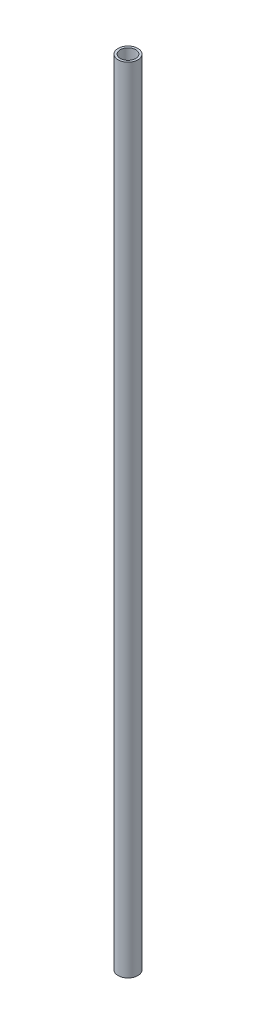
ISO-10303-21;
HEADER;
FILE_DESCRIPTION(('STEP AP214'),'2;1');
FILE_NAME('part.step','',(''),(''),'','','');
FILE_SCHEMA(('AUTOMOTIVE_DESIGN { 1 0 10303 214 1 1 1 1 }'));
ENDSEC;
DATA;
#1=APPLICATION_CONTEXT('core data for automotive mechanical design processes');
#2=APPLICATION_PROTOCOL_DEFINITION('international standard','automotive_design',2000,#1);
#3=PRODUCT_CONTEXT('',#1,'mechanical');
#4=PRODUCT('Part','Part','',(#3));
#5=PRODUCT_RELATED_PRODUCT_CATEGORY('part','',(#4));
#6=PRODUCT_DEFINITION_FORMATION('','',#4);
#7=PRODUCT_DEFINITION_CONTEXT('part definition',#1,'design');
#8=PRODUCT_DEFINITION('design','',#6,#7);
#9=PRODUCT_DEFINITION_SHAPE('','',#8);
#10=(LENGTH_UNIT() NAMED_UNIT(*) SI_UNIT(.MILLI.,.METRE.));
#11=(NAMED_UNIT(*) PLANE_ANGLE_UNIT() SI_UNIT($,.RADIAN.));
#12=(NAMED_UNIT(*) SI_UNIT($,.STERADIAN.) SOLID_ANGLE_UNIT());
#13=UNCERTAINTY_MEASURE_WITH_UNIT(LENGTH_MEASURE(1.E-05),#10,'distance_accuracy_value','');
#14=(GEOMETRIC_REPRESENTATION_CONTEXT(3) GLOBAL_UNCERTAINTY_ASSIGNED_CONTEXT((#13)) GLOBAL_UNIT_ASSIGNED_CONTEXT((#10,
#11,#12)) REPRESENTATION_CONTEXT('',''));
#15=CARTESIAN_POINT('',(0.,0.,0.));
#16=DIRECTION('',(0.,0.,1.));
#17=DIRECTION('',(1.,0.,0.));
#18=AXIS2_PLACEMENT_3D('',#15,#16,#17);
#19=CARTESIAN_POINT('',(0.,127.,0.));
#20=DIRECTION('',(0.,-1.,0.));
#21=DIRECTION('',(0.,0.,-1.));
#22=AXIS2_PLACEMENT_3D('',#19,#20,#21);
#23=CYLINDRICAL_SURFACE('',#22,1.5875);
#24=CARTESIAN_POINT('',(0.,127.,0.));
#25=DIRECTION('',(0.,1.,0.));
#26=DIRECTION('',(0.,0.,1.));
#27=AXIS2_PLACEMENT_3D('',#24,#25,#26);
#28=CIRCLE('',#27,1.5875);
#29=CARTESIAN_POINT('',(0.,127.,1.5875));
#30=VERTEX_POINT('',#29);
#31=EDGE_CURVE('E10',#30,#30,#28,.T.);
#32=ORIENTED_EDGE('',*,*,#31,.F.);
#33=EDGE_LOOP('',(#32));
#34=FACE_BOUND('',#33,.T.);
#35=CARTESIAN_POINT('',(0.,0.,0.));
#36=DIRECTION('',(0.,1.,0.));
#37=DIRECTION('',(0.,0.,1.));
#38=AXIS2_PLACEMENT_3D('',#35,#36,#37);
#39=CIRCLE('',#38,1.5875);
#40=CARTESIAN_POINT('',(0.,0.,1.5875));
#41=VERTEX_POINT('',#40);
#42=EDGE_CURVE('E34',#41,#41,#39,.T.);
#43=ORIENTED_EDGE('',*,*,#42,.T.);
#44=EDGE_LOOP('',(#43));
#45=FACE_BOUND('',#44,.T.);
#46=ADVANCED_FACE('F31',(#34,#45),#23,.T.);
#47=CARTESIAN_POINT('',(0.,127.,0.));
#48=DIRECTION('',(0.,1.,0.));
#49=DIRECTION('',(0.,0.,1.));
#50=AXIS2_PLACEMENT_3D('',#47,#48,#49);
#51=PLANE('',#50);
#52=CARTESIAN_POINT('',(0.,127.,0.));
#53=DIRECTION('',(0.,1.,0.));
#54=DIRECTION('',(0.,0.,1.));
#55=AXIS2_PLACEMENT_3D('',#52,#53,#54);
#56=CIRCLE('',#55,1.2319);
#57=CARTESIAN_POINT('',(0.,127.,1.2319));
#58=VERTEX_POINT('',#57);
#59=EDGE_CURVE('E43',#58,#58,#56,.T.);
#60=ORIENTED_EDGE('',*,*,#59,.F.);
#61=EDGE_LOOP('',(#60));
#62=FACE_BOUND('',#61,.T.);
#63=ORIENTED_EDGE('',*,*,#31,.T.);
#64=EDGE_LOOP('',(#63));
#65=FACE_BOUND('',#64,.T.);
#66=ADVANCED_FACE('F58',(#62,#65),#51,.T.);
#67=CARTESIAN_POINT('',(0.,0.,0.));
#68=DIRECTION('',(0.,1.,0.));
#69=DIRECTION('',(0.,0.,1.));
#70=AXIS2_PLACEMENT_3D('',#67,#68,#69);
#71=PLANE('',#70);
#72=CARTESIAN_POINT('',(0.,0.,0.));
#73=DIRECTION('',(0.,1.,0.));
#74=DIRECTION('',(0.,0.,1.));
#75=AXIS2_PLACEMENT_3D('',#72,#73,#74);
#76=CIRCLE('',#75,1.2319);
#77=CARTESIAN_POINT('',(0.,0.,1.2319));
#78=VERTEX_POINT('',#77);
#79=EDGE_CURVE('E41',#78,#78,#76,.T.);
#80=ORIENTED_EDGE('',*,*,#79,.T.);
#81=EDGE_LOOP('',(#80));
#82=FACE_BOUND('',#81,.T.);
#83=ORIENTED_EDGE('',*,*,#42,.F.);
#84=EDGE_LOOP('',(#83));
#85=FACE_BOUND('',#84,.T.);
#86=ADVANCED_FACE('F49',(#82,#85),#71,.F.);
#87=CARTESIAN_POINT('',(0.,0.,0.));
#88=DIRECTION('',(0.,1.,0.));
#89=DIRECTION('',(0.,0.,1.));
#90=AXIS2_PLACEMENT_3D('',#87,#88,#89);
#91=CYLINDRICAL_SURFACE('',#90,1.2319);
#92=ORIENTED_EDGE('',*,*,#79,.F.);
#93=EDGE_LOOP('',(#92));
#94=FACE_BOUND('',#93,.T.);
#95=ORIENTED_EDGE('',*,*,#59,.T.);
#96=EDGE_LOOP('',(#95));
#97=FACE_BOUND('',#96,.T.);
#98=ADVANCED_FACE('F52',(#94,#97),#91,.F.);
#99=CLOSED_SHELL('',(#46,#66,#86,#98));
#100=MANIFOLD_SOLID_BREP('B2',#99);
#101=ADVANCED_BREP_SHAPE_REPRESENTATION('',(#18,#100),#14);
#102=SHAPE_DEFINITION_REPRESENTATION(#9,#101);
ENDSEC;
END-ISO-10303-21;
